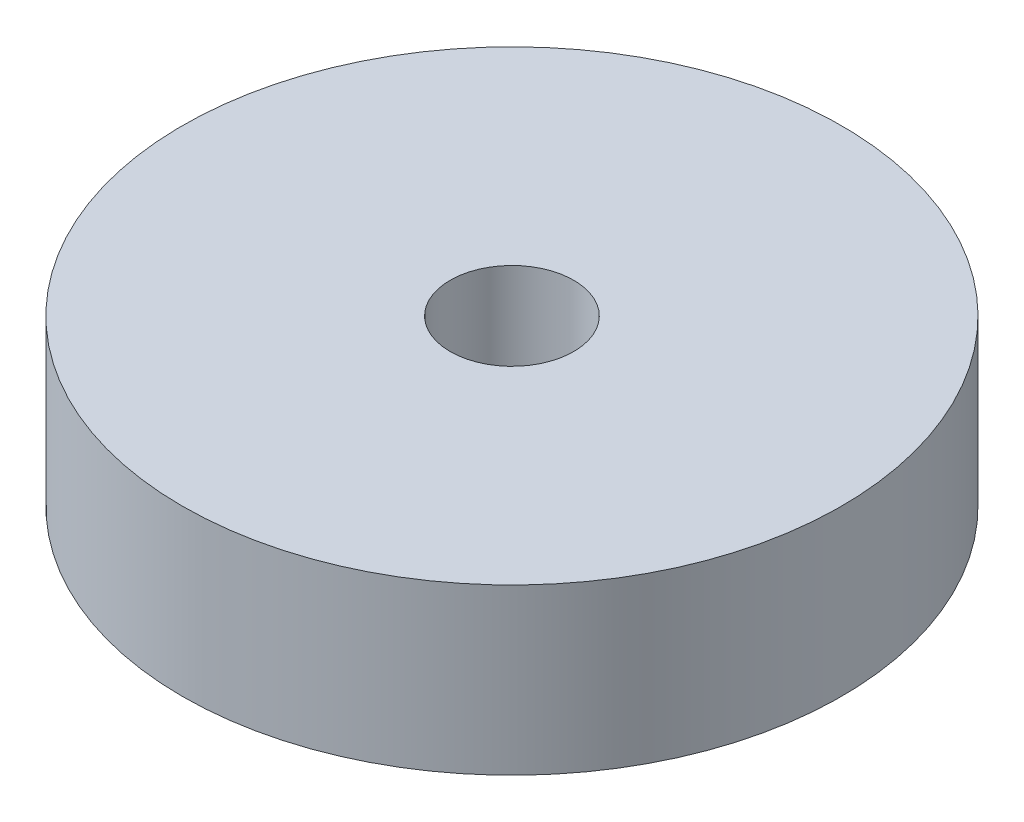
ISO-10303-21;
HEADER;
FILE_DESCRIPTION(('STEP AP214'),'2;1');
FILE_NAME('part.step','',(''),(''),'','','');
FILE_SCHEMA(('AUTOMOTIVE_DESIGN { 1 0 10303 214 1 1 1 1 }'));
ENDSEC;
DATA;
#1=APPLICATION_CONTEXT('core data for automotive mechanical design processes');
#2=APPLICATION_PROTOCOL_DEFINITION('international standard','automotive_design',2000,#1);
#3=PRODUCT_CONTEXT('',#1,'mechanical');
#4=PRODUCT('Part','Part','',(#3));
#5=PRODUCT_RELATED_PRODUCT_CATEGORY('part','',(#4));
#6=PRODUCT_DEFINITION_FORMATION('','',#4);
#7=PRODUCT_DEFINITION_CONTEXT('part definition',#1,'design');
#8=PRODUCT_DEFINITION('design','',#6,#7);
#9=PRODUCT_DEFINITION_SHAPE('','',#8);
#10=(LENGTH_UNIT() NAMED_UNIT(*) SI_UNIT(.MILLI.,.METRE.));
#11=(NAMED_UNIT(*) PLANE_ANGLE_UNIT() SI_UNIT($,.RADIAN.));
#12=(NAMED_UNIT(*) SI_UNIT($,.STERADIAN.) SOLID_ANGLE_UNIT());
#13=UNCERTAINTY_MEASURE_WITH_UNIT(LENGTH_MEASURE(1.E-05),#10,'distance_accuracy_value','');
#14=(GEOMETRIC_REPRESENTATION_CONTEXT(3) GLOBAL_UNCERTAINTY_ASSIGNED_CONTEXT((#13)) GLOBAL_UNIT_ASSIGNED_CONTEXT((#10,
#11,#12)) REPRESENTATION_CONTEXT('',''));
#15=CARTESIAN_POINT('',(0.,0.,0.));
#16=DIRECTION('',(0.,0.,1.));
#17=DIRECTION('',(1.,0.,0.));
#18=AXIS2_PLACEMENT_3D('',#15,#16,#17);
#19=CARTESIAN_POINT('',(0.,10.,0.));
#20=DIRECTION('',(0.,-1.,0.));
#21=DIRECTION('',(0.,0.,-1.));
#22=AXIS2_PLACEMENT_3D('',#19,#20,#21);
#23=CYLINDRICAL_SURFACE('',#22,20.);
#24=CARTESIAN_POINT('',(0.,10.,0.));
#25=DIRECTION('',(0.,1.,0.));
#26=DIRECTION('',(0.,0.,1.));
#27=AXIS2_PLACEMENT_3D('',#24,#25,#26);
#28=CIRCLE('',#27,20.);
#29=CARTESIAN_POINT('',(0.,10.,20.));
#30=VERTEX_POINT('',#29);
#31=EDGE_CURVE('E10',#30,#30,#28,.T.);
#32=ORIENTED_EDGE('',*,*,#31,.F.);
#33=EDGE_LOOP('',(#32));
#34=FACE_BOUND('',#33,.T.);
#35=CARTESIAN_POINT('',(0.,0.,0.));
#36=DIRECTION('',(0.,1.,0.));
#37=DIRECTION('',(0.,0.,1.));
#38=AXIS2_PLACEMENT_3D('',#35,#36,#37);
#39=CIRCLE('',#38,20.);
#40=CARTESIAN_POINT('',(0.,0.,20.));
#41=VERTEX_POINT('',#40);
#42=EDGE_CURVE('E40',#41,#41,#39,.T.);
#43=ORIENTED_EDGE('',*,*,#42,.T.);
#44=EDGE_LOOP('',(#43));
#45=FACE_BOUND('',#44,.T.);
#46=ADVANCED_FACE('F37',(#34,#45),#23,.T.);
#47=CARTESIAN_POINT('',(0.,10.,0.));
#48=DIRECTION('',(0.,1.,0.));
#49=DIRECTION('',(0.,0.,1.));
#50=AXIS2_PLACEMENT_3D('',#47,#48,#49);
#51=PLANE('',#50);
#52=CARTESIAN_POINT('',(0.,10.,0.));
#53=DIRECTION('',(0.,1.,0.));
#54=DIRECTION('',(0.,0.,1.));
#55=AXIS2_PLACEMENT_3D('',#52,#53,#54);
#56=CIRCLE('',#55,3.75);
#57=CARTESIAN_POINT('',(0.,10.,3.75));
#58=VERTEX_POINT('',#57);
#59=EDGE_CURVE('E49',#58,#58,#56,.T.);
#60=ORIENTED_EDGE('',*,*,#59,.F.);
#61=EDGE_LOOP('',(#60));
#62=FACE_BOUND('',#61,.T.);
#63=ORIENTED_EDGE('',*,*,#31,.T.);
#64=EDGE_LOOP('',(#63));
#65=FACE_BOUND('',#64,.T.);
#66=ADVANCED_FACE('F69',(#62,#65),#51,.T.);
#67=CARTESIAN_POINT('',(0.,0.,0.));
#68=DIRECTION('',(0.,1.,0.));
#69=DIRECTION('',(0.,0.,1.));
#70=AXIS2_PLACEMENT_3D('',#67,#68,#69);
#71=PLANE('',#70);
#72=CARTESIAN_POINT('',(0.,0.,0.));
#73=DIRECTION('',(0.,1.,0.));
#74=DIRECTION('',(0.,0.,1.));
#75=AXIS2_PLACEMENT_3D('',#72,#73,#74);
#76=CIRCLE('',#75,3.75);
#77=CARTESIAN_POINT('',(0.,0.,3.75));
#78=VERTEX_POINT('',#77);
#79=EDGE_CURVE('E54',#78,#78,#76,.T.);
#80=ORIENTED_EDGE('',*,*,#79,.T.);
#81=EDGE_LOOP('',(#80));
#82=FACE_BOUND('',#81,.T.);
#83=ORIENTED_EDGE('',*,*,#42,.F.);
#84=EDGE_LOOP('',(#83));
#85=FACE_BOUND('',#84,.T.);
#86=ADVANCED_FACE('F59',(#82,#85),#71,.F.);
#87=CARTESIAN_POINT('',(0.,0.,0.));
#88=DIRECTION('',(0.,1.,0.));
#89=DIRECTION('',(0.,0.,1.));
#90=AXIS2_PLACEMENT_3D('',#87,#88,#89);
#91=CYLINDRICAL_SURFACE('',#90,3.75);
#92=ORIENTED_EDGE('',*,*,#59,.T.);
#93=EDGE_LOOP('',(#92));
#94=FACE_BOUND('',#93,.T.);
#95=ORIENTED_EDGE('',*,*,#79,.F.);
#96=EDGE_LOOP('',(#95));
#97=FACE_BOUND('',#96,.T.);
#98=ADVANCED_FACE('F62',(#94,#97),#91,.F.);
#99=CLOSED_SHELL('',(#46,#66,#86,#98));
#100=MANIFOLD_SOLID_BREP('B2',#99);
#101=ADVANCED_BREP_SHAPE_REPRESENTATION('',(#18,#100),#14);
#102=SHAPE_DEFINITION_REPRESENTATION(#9,#101);
ENDSEC;
END-ISO-10303-21;
